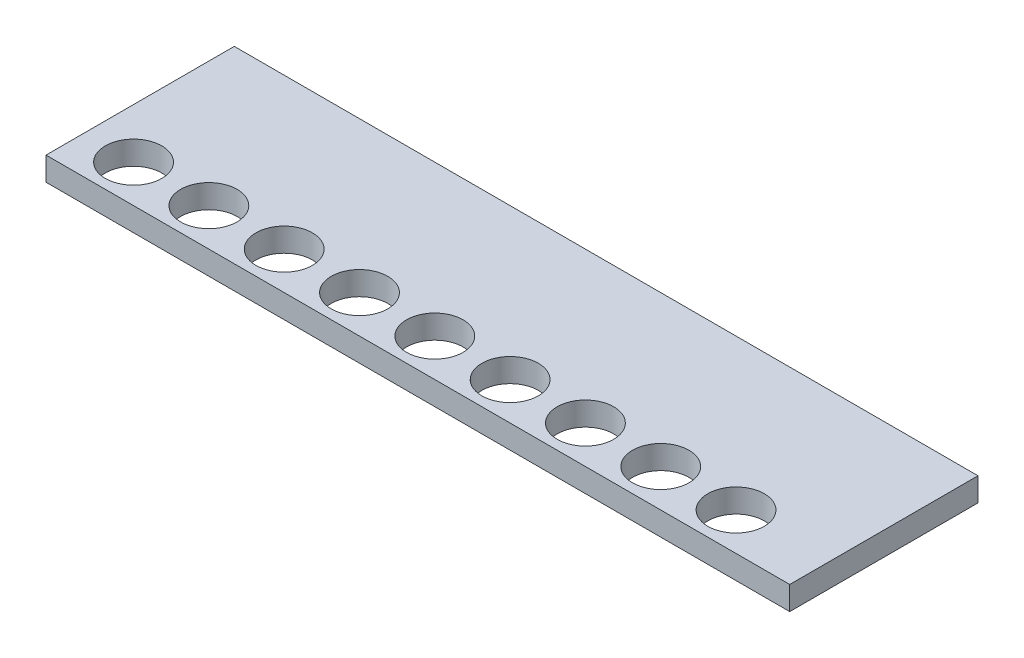
ISO-10303-21;
HEADER;
FILE_DESCRIPTION(('STEP AP214'),'2;1');
FILE_NAME('part.step','',(''),(''),'','','');
FILE_SCHEMA(('AUTOMOTIVE_DESIGN { 1 0 10303 214 1 1 1 1 }'));
ENDSEC;
DATA;
#1=APPLICATION_CONTEXT('core data for automotive mechanical design processes');
#2=APPLICATION_PROTOCOL_DEFINITION('international standard','automotive_design',2000,#1);
#3=PRODUCT_CONTEXT('',#1,'mechanical');
#4=PRODUCT('Part','Part','',(#3));
#5=PRODUCT_RELATED_PRODUCT_CATEGORY('part','',(#4));
#6=PRODUCT_DEFINITION_FORMATION('','',#4);
#7=PRODUCT_DEFINITION_CONTEXT('part definition',#1,'design');
#8=PRODUCT_DEFINITION('design','',#6,#7);
#9=PRODUCT_DEFINITION_SHAPE('','',#8);
#10=(LENGTH_UNIT() NAMED_UNIT(*) SI_UNIT(.MILLI.,.METRE.));
#11=(NAMED_UNIT(*) PLANE_ANGLE_UNIT() SI_UNIT($,.RADIAN.));
#12=(NAMED_UNIT(*) SI_UNIT($,.STERADIAN.) SOLID_ANGLE_UNIT());
#13=UNCERTAINTY_MEASURE_WITH_UNIT(LENGTH_MEASURE(1.E-05),#10,'distance_accuracy_value','');
#14=(GEOMETRIC_REPRESENTATION_CONTEXT(3) GLOBAL_UNCERTAINTY_ASSIGNED_CONTEXT((#13)) GLOBAL_UNIT_ASSIGNED_CONTEXT((#10,
#11,#12)) REPRESENTATION_CONTEXT('',''));
#15=CARTESIAN_POINT('',(0.,0.,0.));
#16=DIRECTION('',(0.,0.,1.));
#17=DIRECTION('',(1.,0.,0.));
#18=AXIS2_PLACEMENT_3D('',#15,#16,#17);
#19=CARTESIAN_POINT('',(50.165,3.175,12.7));
#20=DIRECTION('',(-1.,0.,0.));
#21=DIRECTION('',(0.,0.,1.));
#22=AXIS2_PLACEMENT_3D('',#19,#20,#21);
#23=PLANE('',#22);
#24=DIRECTION('',(0.,0.,-1.));
#25=VECTOR('',#24,1.);
#26=CARTESIAN_POINT('',(50.165,0.,12.7));
#27=LINE('',#26,#25);
#28=CARTESIAN_POINT('',(50.165,0.,12.7));
#29=VERTEX_POINT('',#28);
#30=CARTESIAN_POINT('',(50.165,0.,-12.7));
#31=VERTEX_POINT('',#30);
#32=EDGE_CURVE('E96',#29,#31,#27,.T.);
#33=ORIENTED_EDGE('',*,*,#32,.T.);
#34=DIRECTION('',(0.,-1.,0.));
#35=VECTOR('',#34,1.);
#36=CARTESIAN_POINT('',(50.165,3.175,-12.7));
#37=LINE('',#36,#35);
#38=CARTESIAN_POINT('',(50.165,3.175,-12.7));
#39=VERTEX_POINT('',#38);
#40=EDGE_CURVE('E11',#39,#31,#37,.T.);
#41=ORIENTED_EDGE('',*,*,#40,.F.);
#42=DIRECTION('',(0.,0.,-1.));
#43=VECTOR('',#42,1.);
#44=CARTESIAN_POINT('',(50.165,3.175,12.7));
#45=LINE('',#44,#43);
#46=CARTESIAN_POINT('',(50.165,3.175,12.7));
#47=VERTEX_POINT('',#46);
#48=EDGE_CURVE('E84',#47,#39,#45,.T.);
#49=ORIENTED_EDGE('',*,*,#48,.F.);
#50=DIRECTION('',(0.,-1.,0.));
#51=VECTOR('',#50,1.);
#52=CARTESIAN_POINT('',(50.165,3.175,12.7));
#53=LINE('',#52,#51);
#54=EDGE_CURVE('E92',#47,#29,#53,.T.);
#55=ORIENTED_EDGE('',*,*,#54,.T.);
#56=EDGE_LOOP('',(#33,#41,#49,#55));
#57=FACE_BOUND('',#56,.T.);
#58=ADVANCED_FACE('F33',(#57),#23,.F.);
#59=CARTESIAN_POINT('',(-50.165,3.175,-12.7));
#60=DIRECTION('',(0.,0.,1.));
#61=DIRECTION('',(1.,0.,0.));
#62=AXIS2_PLACEMENT_3D('',#59,#60,#61);
#63=PLANE('',#62);
#64=DIRECTION('',(-1.,0.,0.));
#65=VECTOR('',#64,1.);
#66=CARTESIAN_POINT('',(-50.165,0.,-12.7));
#67=LINE('',#66,#65);
#68=CARTESIAN_POINT('',(-50.165,0.,-12.7));
#69=VERTEX_POINT('',#68);
#70=EDGE_CURVE('E88',#31,#69,#67,.T.);
#71=ORIENTED_EDGE('',*,*,#70,.T.);
#72=DIRECTION('',(0.,-1.,0.));
#73=VECTOR('',#72,1.);
#74=CARTESIAN_POINT('',(-50.165,3.175,-12.7));
#75=LINE('',#74,#73);
#76=CARTESIAN_POINT('',(-50.165,3.175,-12.7));
#77=VERTEX_POINT('',#76);
#78=EDGE_CURVE('E41',#77,#69,#75,.T.);
#79=ORIENTED_EDGE('',*,*,#78,.F.);
#80=DIRECTION('',(-1.,0.,0.));
#81=VECTOR('',#80,1.);
#82=CARTESIAN_POINT('',(-50.165,3.175,-12.7));
#83=LINE('',#82,#81);
#84=EDGE_CURVE('E79',#39,#77,#83,.T.);
#85=ORIENTED_EDGE('',*,*,#84,.F.);
#86=ORIENTED_EDGE('',*,*,#40,.T.);
#87=EDGE_LOOP('',(#71,#79,#85,#86));
#88=FACE_BOUND('',#87,.T.);
#89=ADVANCED_FACE('F87',(#88),#63,.F.);
#90=CARTESIAN_POINT('',(-50.165,3.175,12.7));
#91=DIRECTION('',(1.,0.,0.));
#92=DIRECTION('',(0.,0.,-1.));
#93=AXIS2_PLACEMENT_3D('',#90,#91,#92);
#94=PLANE('',#93);
#95=DIRECTION('',(0.,0.,1.));
#96=VECTOR('',#95,1.);
#97=CARTESIAN_POINT('',(-50.165,0.,12.7));
#98=LINE('',#97,#96);
#99=CARTESIAN_POINT('',(-50.165,0.,12.7));
#100=VERTEX_POINT('',#99);
#101=EDGE_CURVE('E66',#69,#100,#98,.T.);
#102=ORIENTED_EDGE('',*,*,#101,.T.);
#103=DIRECTION('',(0.,-1.,0.));
#104=VECTOR('',#103,1.);
#105=CARTESIAN_POINT('',(-50.165,3.175,12.7));
#106=LINE('',#105,#104);
#107=CARTESIAN_POINT('',(-50.165,3.175,12.7));
#108=VERTEX_POINT('',#107);
#109=EDGE_CURVE('E89',#108,#100,#106,.T.);
#110=ORIENTED_EDGE('',*,*,#109,.F.);
#111=DIRECTION('',(0.,0.,1.));
#112=VECTOR('',#111,1.);
#113=CARTESIAN_POINT('',(-50.165,3.175,12.7));
#114=LINE('',#113,#112);
#115=EDGE_CURVE('E82',#77,#108,#114,.T.);
#116=ORIENTED_EDGE('',*,*,#115,.F.);
#117=ORIENTED_EDGE('',*,*,#78,.T.);
#118=EDGE_LOOP('',(#102,#110,#116,#117));
#119=FACE_BOUND('',#118,.T.);
#120=ADVANCED_FACE('F90',(#119),#94,.F.);
#121=CARTESIAN_POINT('',(-50.165,3.175,12.7));
#122=DIRECTION('',(0.,0.,-1.));
#123=DIRECTION('',(-1.,0.,0.));
#124=AXIS2_PLACEMENT_3D('',#121,#122,#123);
#125=PLANE('',#124);
#126=DIRECTION('',(1.,0.,0.));
#127=VECTOR('',#126,1.);
#128=CARTESIAN_POINT('',(-50.165,0.,12.7));
#129=LINE('',#128,#127);
#130=EDGE_CURVE('E72',#100,#29,#129,.T.);
#131=ORIENTED_EDGE('',*,*,#130,.T.);
#132=ORIENTED_EDGE('',*,*,#54,.F.);
#133=DIRECTION('',(1.,0.,0.));
#134=VECTOR('',#133,1.);
#135=CARTESIAN_POINT('',(-50.165,3.175,12.7));
#136=LINE('',#135,#134);
#137=EDGE_CURVE('E49',#108,#47,#136,.T.);
#138=ORIENTED_EDGE('',*,*,#137,.F.);
#139=ORIENTED_EDGE('',*,*,#109,.T.);
#140=EDGE_LOOP('',(#131,#132,#138,#139));
#141=FACE_BOUND('',#140,.T.);
#142=ADVANCED_FACE('F104',(#141),#125,.F.);
#143=CARTESIAN_POINT('',(0.,3.175,0.));
#144=DIRECTION('',(0.,-1.,0.));
#145=DIRECTION('',(0.,0.,-1.));
#146=AXIS2_PLACEMENT_3D('',#143,#144,#145);
#147=PLANE('',#146);
#148=CARTESIAN_POINT('',(-43.434,3.175,7.62));
#149=DIRECTION('',(0.,1.,0.));
#150=DIRECTION('',(0.,0.,1.));
#151=AXIS2_PLACEMENT_3D('',#148,#149,#150);
#152=CIRCLE('',#151,3.81);
#153=CARTESIAN_POINT('',(-43.434,3.175,11.43));
#154=VERTEX_POINT('',#153);
#155=EDGE_CURVE('E158',#154,#154,#152,.T.);
#156=ORIENTED_EDGE('',*,*,#155,.F.);
#157=EDGE_LOOP('',(#156));
#158=FACE_BOUND('',#157,.T.);
#159=CARTESIAN_POINT('',(-33.274,3.175,7.62));
#160=DIRECTION('',(0.,1.,0.));
#161=DIRECTION('',(0.,0.,1.));
#162=AXIS2_PLACEMENT_3D('',#159,#160,#161);
#163=CIRCLE('',#162,3.81);
#164=CARTESIAN_POINT('',(-33.274,3.175,11.43));
#165=VERTEX_POINT('',#164);
#166=EDGE_CURVE('E152',#165,#165,#163,.T.);
#167=ORIENTED_EDGE('',*,*,#166,.F.);
#168=EDGE_LOOP('',(#167));
#169=FACE_BOUND('',#168,.T.);
#170=CARTESIAN_POINT('',(-23.114,3.175,7.62));
#171=DIRECTION('',(0.,1.,0.));
#172=DIRECTION('',(0.,0.,1.));
#173=AXIS2_PLACEMENT_3D('',#170,#171,#172);
#174=CIRCLE('',#173,3.81);
#175=CARTESIAN_POINT('',(-23.114,3.175,11.43));
#176=VERTEX_POINT('',#175);
#177=EDGE_CURVE('E146',#176,#176,#174,.T.);
#178=ORIENTED_EDGE('',*,*,#177,.F.);
#179=EDGE_LOOP('',(#178));
#180=FACE_BOUND('',#179,.T.);
#181=CARTESIAN_POINT('',(-12.954,3.175,7.62));
#182=DIRECTION('',(0.,1.,0.));
#183=DIRECTION('',(0.,0.,1.));
#184=AXIS2_PLACEMENT_3D('',#181,#182,#183);
#185=CIRCLE('',#184,3.81);
#186=CARTESIAN_POINT('',(-12.954,3.175,11.43));
#187=VERTEX_POINT('',#186);
#188=EDGE_CURVE('E140',#187,#187,#185,.T.);
#189=ORIENTED_EDGE('',*,*,#188,.F.);
#190=EDGE_LOOP('',(#189));
#191=FACE_BOUND('',#190,.T.);
#192=CARTESIAN_POINT('',(-2.79399999999999,3.175,7.62));
#193=DIRECTION('',(0.,1.,0.));
#194=DIRECTION('',(0.,0.,1.));
#195=AXIS2_PLACEMENT_3D('',#192,#193,#194);
#196=CIRCLE('',#195,3.81);
#197=CARTESIAN_POINT('',(-2.79399999999999,3.175,11.43));
#198=VERTEX_POINT('',#197);
#199=EDGE_CURVE('E134',#198,#198,#196,.T.);
#200=ORIENTED_EDGE('',*,*,#199,.F.);
#201=EDGE_LOOP('',(#200));
#202=FACE_BOUND('',#201,.T.);
#203=CARTESIAN_POINT('',(7.36600000000001,3.175,7.62));
#204=DIRECTION('',(0.,1.,0.));
#205=DIRECTION('',(0.,0.,1.));
#206=AXIS2_PLACEMENT_3D('',#203,#204,#205);
#207=CIRCLE('',#206,3.81);
#208=CARTESIAN_POINT('',(7.36600000000001,3.175,11.43));
#209=VERTEX_POINT('',#208);
#210=EDGE_CURVE('E128',#209,#209,#207,.T.);
#211=ORIENTED_EDGE('',*,*,#210,.F.);
#212=EDGE_LOOP('',(#211));
#213=FACE_BOUND('',#212,.T.);
#214=CARTESIAN_POINT('',(17.526,3.175,7.62));
#215=DIRECTION('',(0.,1.,0.));
#216=DIRECTION('',(0.,0.,1.));
#217=AXIS2_PLACEMENT_3D('',#214,#215,#216);
#218=CIRCLE('',#217,3.81);
#219=CARTESIAN_POINT('',(17.526,3.175,11.43));
#220=VERTEX_POINT('',#219);
#221=EDGE_CURVE('E122',#220,#220,#218,.T.);
#222=ORIENTED_EDGE('',*,*,#221,.F.);
#223=EDGE_LOOP('',(#222));
#224=FACE_BOUND('',#223,.T.);
#225=CARTESIAN_POINT('',(27.686,3.175,7.62));
#226=DIRECTION('',(0.,1.,0.));
#227=DIRECTION('',(0.,0.,1.));
#228=AXIS2_PLACEMENT_3D('',#225,#226,#227);
#229=CIRCLE('',#228,3.81);
#230=CARTESIAN_POINT('',(27.686,3.175,11.43));
#231=VERTEX_POINT('',#230);
#232=EDGE_CURVE('E116',#231,#231,#229,.T.);
#233=ORIENTED_EDGE('',*,*,#232,.F.);
#234=EDGE_LOOP('',(#233));
#235=FACE_BOUND('',#234,.T.);
#236=CARTESIAN_POINT('',(37.846,3.175,7.62));
#237=DIRECTION('',(0.,1.,0.));
#238=DIRECTION('',(0.,0.,1.));
#239=AXIS2_PLACEMENT_3D('',#236,#237,#238);
#240=CIRCLE('',#239,3.81);
#241=CARTESIAN_POINT('',(37.846,3.175,11.43));
#242=VERTEX_POINT('',#241);
#243=EDGE_CURVE('E110',#242,#242,#240,.T.);
#244=ORIENTED_EDGE('',*,*,#243,.F.);
#245=EDGE_LOOP('',(#244));
#246=FACE_BOUND('',#245,.T.);
#247=ORIENTED_EDGE('',*,*,#48,.T.);
#248=ORIENTED_EDGE('',*,*,#84,.T.);
#249=ORIENTED_EDGE('',*,*,#115,.T.);
#250=ORIENTED_EDGE('',*,*,#137,.T.);
#251=EDGE_LOOP('',(#247,#248,#249,#250));
#252=FACE_BOUND('',#251,.T.);
#253=ADVANCED_FACE('F80',(#158,#169,#180,#191,#202,#213,#224,#235,#246,#252),#147,.F.);
#254=CARTESIAN_POINT('',(0.,0.,0.));
#255=DIRECTION('',(0.,-1.,0.));
#256=DIRECTION('',(0.,0.,-1.));
#257=AXIS2_PLACEMENT_3D('',#254,#255,#256);
#258=PLANE('',#257);
#259=CARTESIAN_POINT('',(-43.434,0.,7.62));
#260=DIRECTION('',(0.,1.,0.));
#261=DIRECTION('',(0.,0.,1.));
#262=AXIS2_PLACEMENT_3D('',#259,#260,#261);
#263=CIRCLE('',#262,3.81);
#264=CARTESIAN_POINT('',(-43.434,0.,11.43));
#265=VERTEX_POINT('',#264);
#266=EDGE_CURVE('E99',#265,#265,#263,.T.);
#267=ORIENTED_EDGE('',*,*,#266,.T.);
#268=EDGE_LOOP('',(#267));
#269=FACE_BOUND('',#268,.T.);
#270=CARTESIAN_POINT('',(-33.274,0.,7.62));
#271=DIRECTION('',(0.,1.,0.));
#272=DIRECTION('',(0.,0.,1.));
#273=AXIS2_PLACEMENT_3D('',#270,#271,#272);
#274=CIRCLE('',#273,3.81);
#275=CARTESIAN_POINT('',(-33.274,0.,11.43));
#276=VERTEX_POINT('',#275);
#277=EDGE_CURVE('E155',#276,#276,#274,.T.);
#278=ORIENTED_EDGE('',*,*,#277,.T.);
#279=EDGE_LOOP('',(#278));
#280=FACE_BOUND('',#279,.T.);
#281=CARTESIAN_POINT('',(-23.114,0.,7.62));
#282=DIRECTION('',(0.,1.,0.));
#283=DIRECTION('',(0.,0.,1.));
#284=AXIS2_PLACEMENT_3D('',#281,#282,#283);
#285=CIRCLE('',#284,3.81);
#286=CARTESIAN_POINT('',(-23.114,0.,11.43));
#287=VERTEX_POINT('',#286);
#288=EDGE_CURVE('E149',#287,#287,#285,.T.);
#289=ORIENTED_EDGE('',*,*,#288,.T.);
#290=EDGE_LOOP('',(#289));
#291=FACE_BOUND('',#290,.T.);
#292=CARTESIAN_POINT('',(-12.954,0.,7.62));
#293=DIRECTION('',(0.,1.,0.));
#294=DIRECTION('',(0.,0.,1.));
#295=AXIS2_PLACEMENT_3D('',#292,#293,#294);
#296=CIRCLE('',#295,3.81);
#297=CARTESIAN_POINT('',(-12.954,0.,11.43));
#298=VERTEX_POINT('',#297);
#299=EDGE_CURVE('E143',#298,#298,#296,.T.);
#300=ORIENTED_EDGE('',*,*,#299,.T.);
#301=EDGE_LOOP('',(#300));
#302=FACE_BOUND('',#301,.T.);
#303=CARTESIAN_POINT('',(-2.79399999999999,0.,7.62));
#304=DIRECTION('',(0.,1.,0.));
#305=DIRECTION('',(0.,0.,1.));
#306=AXIS2_PLACEMENT_3D('',#303,#304,#305);
#307=CIRCLE('',#306,3.81);
#308=CARTESIAN_POINT('',(-2.79399999999999,0.,11.43));
#309=VERTEX_POINT('',#308);
#310=EDGE_CURVE('E137',#309,#309,#307,.T.);
#311=ORIENTED_EDGE('',*,*,#310,.T.);
#312=EDGE_LOOP('',(#311));
#313=FACE_BOUND('',#312,.T.);
#314=CARTESIAN_POINT('',(7.36600000000001,0.,7.62));
#315=DIRECTION('',(0.,1.,0.));
#316=DIRECTION('',(0.,0.,1.));
#317=AXIS2_PLACEMENT_3D('',#314,#315,#316);
#318=CIRCLE('',#317,3.81);
#319=CARTESIAN_POINT('',(7.36600000000001,0.,11.43));
#320=VERTEX_POINT('',#319);
#321=EDGE_CURVE('E131',#320,#320,#318,.T.);
#322=ORIENTED_EDGE('',*,*,#321,.T.);
#323=EDGE_LOOP('',(#322));
#324=FACE_BOUND('',#323,.T.);
#325=CARTESIAN_POINT('',(17.526,0.,7.62));
#326=DIRECTION('',(0.,1.,0.));
#327=DIRECTION('',(0.,0.,1.));
#328=AXIS2_PLACEMENT_3D('',#325,#326,#327);
#329=CIRCLE('',#328,3.81);
#330=CARTESIAN_POINT('',(17.526,0.,11.43));
#331=VERTEX_POINT('',#330);
#332=EDGE_CURVE('E125',#331,#331,#329,.T.);
#333=ORIENTED_EDGE('',*,*,#332,.T.);
#334=EDGE_LOOP('',(#333));
#335=FACE_BOUND('',#334,.T.);
#336=CARTESIAN_POINT('',(27.686,0.,7.62));
#337=DIRECTION('',(0.,1.,0.));
#338=DIRECTION('',(0.,0.,1.));
#339=AXIS2_PLACEMENT_3D('',#336,#337,#338);
#340=CIRCLE('',#339,3.81);
#341=CARTESIAN_POINT('',(27.686,0.,11.43));
#342=VERTEX_POINT('',#341);
#343=EDGE_CURVE('E119',#342,#342,#340,.T.);
#344=ORIENTED_EDGE('',*,*,#343,.T.);
#345=EDGE_LOOP('',(#344));
#346=FACE_BOUND('',#345,.T.);
#347=CARTESIAN_POINT('',(37.846,0.,7.62));
#348=DIRECTION('',(0.,1.,0.));
#349=DIRECTION('',(0.,0.,1.));
#350=AXIS2_PLACEMENT_3D('',#347,#348,#349);
#351=CIRCLE('',#350,3.81);
#352=CARTESIAN_POINT('',(37.846,0.,11.43));
#353=VERTEX_POINT('',#352);
#354=EDGE_CURVE('E113',#353,#353,#351,.T.);
#355=ORIENTED_EDGE('',*,*,#354,.T.);
#356=EDGE_LOOP('',(#355));
#357=FACE_BOUND('',#356,.T.);
#358=ORIENTED_EDGE('',*,*,#32,.F.);
#359=ORIENTED_EDGE('',*,*,#130,.F.);
#360=ORIENTED_EDGE('',*,*,#101,.F.);
#361=ORIENTED_EDGE('',*,*,#70,.F.);
#362=EDGE_LOOP('',(#358,#359,#360,#361));
#363=FACE_BOUND('',#362,.T.);
#364=ADVANCED_FACE('F107',(#269,#280,#291,#302,#313,#324,#335,#346,#357,#363),#258,.T.);
#365=CARTESIAN_POINT('',(37.846,0.,7.62));
#366=DIRECTION('',(0.,1.,0.));
#367=DIRECTION('',(0.,0.,1.));
#368=AXIS2_PLACEMENT_3D('',#365,#366,#367);
#369=CYLINDRICAL_SURFACE('',#368,3.81);
#370=ORIENTED_EDGE('',*,*,#354,.F.);
#371=EDGE_LOOP('',(#370));
#372=FACE_BOUND('',#371,.T.);
#373=ORIENTED_EDGE('',*,*,#243,.T.);
#374=EDGE_LOOP('',(#373));
#375=FACE_BOUND('',#374,.T.);
#376=ADVANCED_FACE('F192',(#372,#375),#369,.F.);
#377=CARTESIAN_POINT('',(27.686,0.,7.62));
#378=DIRECTION('',(0.,1.,0.));
#379=DIRECTION('',(0.,0.,1.));
#380=AXIS2_PLACEMENT_3D('',#377,#378,#379);
#381=CYLINDRICAL_SURFACE('',#380,3.81);
#382=ORIENTED_EDGE('',*,*,#343,.F.);
#383=EDGE_LOOP('',(#382));
#384=FACE_BOUND('',#383,.T.);
#385=ORIENTED_EDGE('',*,*,#232,.T.);
#386=EDGE_LOOP('',(#385));
#387=FACE_BOUND('',#386,.T.);
#388=ADVANCED_FACE('F194',(#384,#387),#381,.F.);
#389=CARTESIAN_POINT('',(17.526,0.,7.62));
#390=DIRECTION('',(0.,1.,0.));
#391=DIRECTION('',(0.,0.,1.));
#392=AXIS2_PLACEMENT_3D('',#389,#390,#391);
#393=CYLINDRICAL_SURFACE('',#392,3.81);
#394=ORIENTED_EDGE('',*,*,#332,.F.);
#395=EDGE_LOOP('',(#394));
#396=FACE_BOUND('',#395,.T.);
#397=ORIENTED_EDGE('',*,*,#221,.T.);
#398=EDGE_LOOP('',(#397));
#399=FACE_BOUND('',#398,.T.);
#400=ADVANCED_FACE('F201',(#396,#399),#393,.F.);
#401=CARTESIAN_POINT('',(7.36600000000001,0.,7.62));
#402=DIRECTION('',(0.,1.,0.));
#403=DIRECTION('',(0.,0.,1.));
#404=AXIS2_PLACEMENT_3D('',#401,#402,#403);
#405=CYLINDRICAL_SURFACE('',#404,3.81);
#406=ORIENTED_EDGE('',*,*,#321,.F.);
#407=EDGE_LOOP('',(#406));
#408=FACE_BOUND('',#407,.T.);
#409=ORIENTED_EDGE('',*,*,#210,.T.);
#410=EDGE_LOOP('',(#409));
#411=FACE_BOUND('',#410,.T.);
#412=ADVANCED_FACE('F247',(#408,#411),#405,.F.);
#413=CARTESIAN_POINT('',(-2.79399999999999,0.,7.62));
#414=DIRECTION('',(0.,1.,0.));
#415=DIRECTION('',(0.,0.,1.));
#416=AXIS2_PLACEMENT_3D('',#413,#414,#415);
#417=CYLINDRICAL_SURFACE('',#416,3.81);
#418=ORIENTED_EDGE('',*,*,#310,.F.);
#419=EDGE_LOOP('',(#418));
#420=FACE_BOUND('',#419,.T.);
#421=ORIENTED_EDGE('',*,*,#199,.T.);
#422=EDGE_LOOP('',(#421));
#423=FACE_BOUND('',#422,.T.);
#424=ADVANCED_FACE('F257',(#420,#423),#417,.F.);
#425=CARTESIAN_POINT('',(-12.954,0.,7.62));
#426=DIRECTION('',(0.,1.,0.));
#427=DIRECTION('',(0.,0.,1.));
#428=AXIS2_PLACEMENT_3D('',#425,#426,#427);
#429=CYLINDRICAL_SURFACE('',#428,3.81);
#430=ORIENTED_EDGE('',*,*,#299,.F.);
#431=EDGE_LOOP('',(#430));
#432=FACE_BOUND('',#431,.T.);
#433=ORIENTED_EDGE('',*,*,#188,.T.);
#434=EDGE_LOOP('',(#433));
#435=FACE_BOUND('',#434,.T.);
#436=ADVANCED_FACE('F267',(#432,#435),#429,.F.);
#437=CARTESIAN_POINT('',(-23.114,0.,7.62));
#438=DIRECTION('',(0.,1.,0.));
#439=DIRECTION('',(0.,0.,1.));
#440=AXIS2_PLACEMENT_3D('',#437,#438,#439);
#441=CYLINDRICAL_SURFACE('',#440,3.81);
#442=ORIENTED_EDGE('',*,*,#288,.F.);
#443=EDGE_LOOP('',(#442));
#444=FACE_BOUND('',#443,.T.);
#445=ORIENTED_EDGE('',*,*,#177,.T.);
#446=EDGE_LOOP('',(#445));
#447=FACE_BOUND('',#446,.T.);
#448=ADVANCED_FACE('F277',(#444,#447),#441,.F.);
#449=CARTESIAN_POINT('',(-33.274,0.,7.62));
#450=DIRECTION('',(0.,1.,0.));
#451=DIRECTION('',(0.,0.,1.));
#452=AXIS2_PLACEMENT_3D('',#449,#450,#451);
#453=CYLINDRICAL_SURFACE('',#452,3.81);
#454=ORIENTED_EDGE('',*,*,#277,.F.);
#455=EDGE_LOOP('',(#454));
#456=FACE_BOUND('',#455,.T.);
#457=ORIENTED_EDGE('',*,*,#166,.T.);
#458=EDGE_LOOP('',(#457));
#459=FACE_BOUND('',#458,.T.);
#460=ADVANCED_FACE('F169',(#456,#459),#453,.F.);
#461=CARTESIAN_POINT('',(-43.434,0.,7.62));
#462=DIRECTION('',(0.,1.,0.));
#463=DIRECTION('',(0.,0.,1.));
#464=AXIS2_PLACEMENT_3D('',#461,#462,#463);
#465=CYLINDRICAL_SURFACE('',#464,3.81);
#466=ORIENTED_EDGE('',*,*,#266,.F.);
#467=EDGE_LOOP('',(#466));
#468=FACE_BOUND('',#467,.T.);
#469=ORIENTED_EDGE('',*,*,#155,.T.);
#470=EDGE_LOOP('',(#469));
#471=FACE_BOUND('',#470,.T.);
#472=ADVANCED_FACE('F166',(#468,#471),#465,.F.);
#473=CLOSED_SHELL('',(#58,#89,#120,#142,#253,#364,#376,#388,#400,#412,#424,#436,#448,#460,#472));
#474=MANIFOLD_SOLID_BREP('B2',#473);
#475=ADVANCED_BREP_SHAPE_REPRESENTATION('',(#18,#474),#14);
#476=SHAPE_DEFINITION_REPRESENTATION(#9,#475);
ENDSEC;
END-ISO-10303-21;
